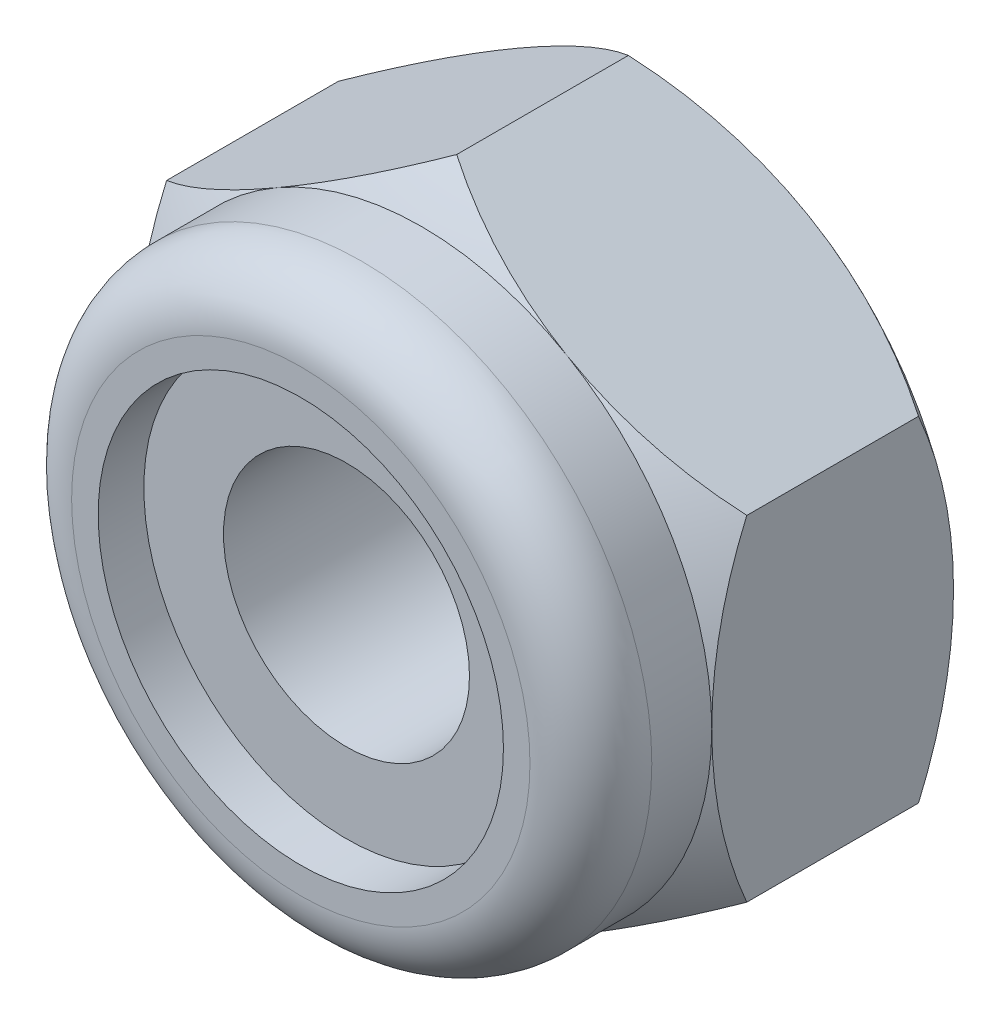
ISO-10303-21;
HEADER;
FILE_DESCRIPTION(('STEP AP214'),'2;1');
FILE_NAME('part.step','',(''),(''),'','','');
FILE_SCHEMA(('AUTOMOTIVE_DESIGN { 1 0 10303 214 1 1 1 1 }'));
ENDSEC;
DATA;
#1=APPLICATION_CONTEXT('core data for automotive mechanical design processes');
#2=APPLICATION_PROTOCOL_DEFINITION('international standard','automotive_design',2000,#1);
#3=PRODUCT_CONTEXT('',#1,'mechanical');
#4=PRODUCT('Part','Part','',(#3));
#5=PRODUCT_RELATED_PRODUCT_CATEGORY('part','',(#4));
#6=PRODUCT_DEFINITION_FORMATION('','',#4);
#7=PRODUCT_DEFINITION_CONTEXT('part definition',#1,'design');
#8=PRODUCT_DEFINITION('design','',#6,#7);
#9=PRODUCT_DEFINITION_SHAPE('','',#8);
#10=(LENGTH_UNIT() NAMED_UNIT(*) SI_UNIT(.MILLI.,.METRE.));
#11=(NAMED_UNIT(*) PLANE_ANGLE_UNIT() SI_UNIT($,.RADIAN.));
#12=(NAMED_UNIT(*) SI_UNIT($,.STERADIAN.) SOLID_ANGLE_UNIT());
#13=UNCERTAINTY_MEASURE_WITH_UNIT(LENGTH_MEASURE(1.E-05),#10,'distance_accuracy_value','');
#14=(GEOMETRIC_REPRESENTATION_CONTEXT(3) GLOBAL_UNCERTAINTY_ASSIGNED_CONTEXT((#13)) GLOBAL_UNIT_ASSIGNED_CONTEXT((#10,
#11,#12)) REPRESENTATION_CONTEXT('',''));
#15=CARTESIAN_POINT('',(0.,0.,0.));
#16=DIRECTION('',(0.,0.,1.));
#17=DIRECTION('',(1.,0.,0.));
#18=AXIS2_PLACEMENT_3D('',#15,#16,#17);
#19=CARTESIAN_POINT('',(0.,1.24344978758018E-11,4.95312499999961));
#20=DIRECTION('',(0.,0.,1.));
#21=DIRECTION('',(1.,0.,0.));
#22=AXIS2_PLACEMENT_3D('',#19,#20,#21);
#23=TOROIDAL_SURFACE('',#22,3.7625,1.);
#24=CARTESIAN_POINT('',(0.,1.24344978758018E-11,4.95312499999961));
#25=DIRECTION('',(0.,0.,-1.));
#26=DIRECTION('',(-1.,0.,0.));
#27=AXIS2_PLACEMENT_3D('',#24,#25,#26);
#28=CIRCLE('',#27,4.7625);
#29=CARTESIAN_POINT('',(-4.7625,1.24344978758018E-11,4.95312499999961));
#30=VERTEX_POINT('',#29);
#31=EDGE_CURVE('E161',#30,#30,#28,.T.);
#32=ORIENTED_EDGE('',*,*,#31,.F.);
#33=EDGE_LOOP('',(#32));
#34=FACE_BOUND('',#33,.T.);
#35=CARTESIAN_POINT('',(0.,1.24344978758018E-11,5.95312499999961));
#36=DIRECTION('',(0.,0.,-1.));
#37=DIRECTION('',(1.,0.,0.));
#38=AXIS2_PLACEMENT_3D('',#35,#36,#37);
#39=CIRCLE('',#38,3.7625);
#40=CARTESIAN_POINT('',(-3.7625,1.24349831420959E-11,5.95312499999961));
#41=VERTEX_POINT('',#40);
#42=CARTESIAN_POINT('',(3.7625,1.24344978758018E-11,5.95312499999961));
#43=VERTEX_POINT('',#42);
#44=EDGE_CURVE('E169',#41,#43,#39,.F.);
#45=ORIENTED_EDGE('',*,*,#44,.F.);
#46=CARTESIAN_POINT('',(0.,1.24344978758018E-11,5.95312499999961));
#47=DIRECTION('',(0.,0.,-1.));
#48=DIRECTION('',(-1.,0.,0.));
#49=AXIS2_PLACEMENT_3D('',#46,#47,#48);
#50=CIRCLE('',#49,3.7625);
#51=EDGE_CURVE('E167',#43,#41,#50,.F.);
#52=ORIENTED_EDGE('',*,*,#51,.F.);
#53=EDGE_LOOP('',(#45,#52));
#54=FACE_BOUND('',#53,.T.);
#55=ADVANCED_FACE('F16',(#34,#54),#23,.T.);
#56=CARTESIAN_POINT('',(0.,1.24344978758018E-11,5.95312499999961));
#57=DIRECTION('',(0.,0.,1.));
#58=DIRECTION('',(1.,0.,0.));
#59=AXIS2_PLACEMENT_3D('',#56,#57,#58);
#60=PLANE('',#59);
#61=CARTESIAN_POINT('',(0.,1.24344978758018E-11,5.95312499999961));
#62=DIRECTION('',(0.,0.,1.));
#63=DIRECTION('',(1.,0.,0.));
#64=AXIS2_PLACEMENT_3D('',#61,#62,#63);
#65=CIRCLE('',#64,3.32676299779793);
#66=CARTESIAN_POINT('',(3.32676299779793,1.24344978758018E-11,5.95312499999961));
#67=VERTEX_POINT('',#66);
#68=EDGE_CURVE('E128',#67,#67,#65,.F.);
#69=ORIENTED_EDGE('',*,*,#68,.T.);
#70=EDGE_LOOP('',(#69));
#71=FACE_BOUND('',#70,.T.);
#72=ORIENTED_EDGE('',*,*,#51,.T.);
#73=ORIENTED_EDGE('',*,*,#44,.T.);
#74=EDGE_LOOP('',(#72,#73));
#75=FACE_BOUND('',#74,.T.);
#76=ADVANCED_FACE('F175',(#71,#75),#60,.T.);
#77=CARTESIAN_POINT('',(0.,1.24344978758018E-11,5.95312499999961));
#78=DIRECTION('',(0.,0.,-1.));
#79=DIRECTION('',(-1.,0.,0.));
#80=AXIS2_PLACEMENT_3D('',#77,#78,#79);
#81=CYLINDRICAL_SURFACE('',#80,4.7625);
#82=ORIENTED_EDGE('',*,*,#31,.T.);
#83=EDGE_LOOP('',(#82));
#84=FACE_BOUND('',#83,.T.);
#85=CARTESIAN_POINT('',(0.,1.24344978758018E-11,3.96875000000001));
#86=DIRECTION('',(0.,0.,-1.));
#87=DIRECTION('',(-1.,0.,0.));
#88=AXIS2_PLACEMENT_3D('',#85,#86,#87);
#89=CIRCLE('',#88,4.7625);
#90=CARTESIAN_POINT('',(2.3812499999973,-4.12444598551874,3.96875));
#91=VERTEX_POINT('',#90);
#92=CARTESIAN_POINT('',(-2.3812499999973,-4.12444598551874,3.96875000000001));
#93=VERTEX_POINT('',#92);
#94=EDGE_CURVE('E110',#91,#93,#89,.T.);
#95=ORIENTED_EDGE('',*,*,#94,.F.);
#96=CARTESIAN_POINT('',(0.,1.24344978758018E-11,3.96875000000001));
#97=DIRECTION('',(0.,0.,-1.));
#98=DIRECTION('',(-1.,0.,0.));
#99=AXIS2_PLACEMENT_3D('',#96,#97,#98);
#100=CIRCLE('',#99,4.7625);
#101=CARTESIAN_POINT('',(4.76249999999073,3.10946746982632E-12,3.96875000000644));
#102=VERTEX_POINT('',#101);
#103=EDGE_CURVE('E151',#102,#91,#100,.T.);
#104=ORIENTED_EDGE('',*,*,#103,.F.);
#105=CARTESIAN_POINT('',(0.,1.24344978758018E-11,3.96875000000001));
#106=DIRECTION('',(0.,0.,-1.));
#107=DIRECTION('',(-1.,0.,0.));
#108=AXIS2_PLACEMENT_3D('',#105,#106,#107);
#109=CIRCLE('',#108,4.7625);
#110=CARTESIAN_POINT('',(2.38125000000269,4.12444598552807,3.96875));
#111=VERTEX_POINT('',#110);
#112=EDGE_CURVE('E153',#111,#102,#109,.T.);
#113=ORIENTED_EDGE('',*,*,#112,.F.);
#114=CARTESIAN_POINT('',(0.,1.24344978758018E-11,3.96874999999923));
#115=DIRECTION('',(0.,0.,-1.));
#116=DIRECTION('',(-1.,0.,0.));
#117=AXIS2_PLACEMENT_3D('',#114,#115,#116);
#118=CIRCLE('',#117,4.7625);
#119=CARTESIAN_POINT('',(-2.38125000000269,4.12444598552807,3.96874999999961));
#120=VERTEX_POINT('',#119);
#121=EDGE_CURVE('E156',#120,#111,#118,.T.);
#122=ORIENTED_EDGE('',*,*,#121,.F.);
#123=CARTESIAN_POINT('',(0.,1.24344978758018E-11,3.96874999999923));
#124=DIRECTION('',(0.,0.,-1.));
#125=DIRECTION('',(-1.,0.,0.));
#126=AXIS2_PLACEMENT_3D('',#123,#124,#125);
#127=CIRCLE('',#126,4.7625);
#128=CARTESIAN_POINT('',(-4.7624999999909,6.21720651084527E-12,3.96875000000634));
#129=VERTEX_POINT('',#128);
#130=EDGE_CURVE('E113',#129,#120,#127,.T.);
#131=ORIENTED_EDGE('',*,*,#130,.F.);
#132=CARTESIAN_POINT('',(0.,1.24344978758018E-11,3.96875000000001));
#133=DIRECTION('',(0.,0.,-1.));
#134=DIRECTION('',(-1.,0.,0.));
#135=AXIS2_PLACEMENT_3D('',#132,#133,#134);
#136=CIRCLE('',#135,4.7625);
#137=EDGE_CURVE('E107',#93,#129,#136,.T.);
#138=ORIENTED_EDGE('',*,*,#137,.F.);
#139=EDGE_LOOP('',(#95,#104,#113,#122,#131,#138));
#140=FACE_BOUND('',#139,.T.);
#141=ADVANCED_FACE('F109',(#84,#140),#81,.T.);
#142=CARTESIAN_POINT('',(0.,1.24344978758018E-11,5.95312499999961));
#143=DIRECTION('',(0.,0.,1.));
#144=DIRECTION('',(1.,0.,0.));
#145=AXIS2_PLACEMENT_3D('',#142,#143,#144);
#146=CYLINDRICAL_SURFACE('',#145,3.32676299779793);
#147=CARTESIAN_POINT('',(0.,1.24344978758018E-11,5.20312499999961));
#148=DIRECTION('',(0.,0.,1.));
#149=DIRECTION('',(1.,0.,0.));
#150=AXIS2_PLACEMENT_3D('',#147,#148,#149);
#151=CIRCLE('',#150,3.32676299779793);
#152=CARTESIAN_POINT('',(3.32676299779793,1.24344978758018E-11,5.20312499999961));
#153=VERTEX_POINT('',#152);
#154=EDGE_CURVE('E148',#153,#153,#151,.F.);
#155=ORIENTED_EDGE('',*,*,#154,.T.);
#156=EDGE_LOOP('',(#155));
#157=FACE_BOUND('',#156,.T.);
#158=ORIENTED_EDGE('',*,*,#68,.F.);
#159=EDGE_LOOP('',(#158));
#160=FACE_BOUND('',#159,.T.);
#161=ADVANCED_FACE('F295',(#157,#160),#146,.F.);
#162=CARTESIAN_POINT('',(0.,0.,-2.89662617308755));
#163=DIRECTION('',(1.,0.,0.));
#164=DIRECTION('',(0.,-0.514062280042827,0.857752861981334));
#165=AXIS2_PLACEMENT_3D('',#162,#163,#164);
#166=SPHERICAL_SURFACE('',#165,8.35552489362568);
#167=CARTESIAN_POINT('',(2.38125000000001,-4.12444598552341,-2.89662617308755));
#168=DIRECTION('',(0.5,-0.866025403784439,0.));
#169=DIRECTION('',(0.866025403784439,0.5,0.));
#170=AXIS2_PLACEMENT_3D('',#167,#168,#169);
#171=CIRCLE('',#170,6.86537617308755);
#172=CARTESIAN_POINT('',(3.73850256307762E-11,-5.4992613140528,3.39407499989474));
#173=VERTEX_POINT('',#172);
#174=EDGE_CURVE('E126',#91,#173,#171,.T.);
#175=ORIENTED_EDGE('',*,*,#174,.F.);
#176=ORIENTED_EDGE('',*,*,#94,.T.);
#177=CARTESIAN_POINT('',(-2.38125000000001,-4.12444598552341,-2.89662617308755));
#178=DIRECTION('',(-0.5,-0.866025403784439,0.));
#179=DIRECTION('',(0.866025403784439,-0.5,0.));
#180=AXIS2_PLACEMENT_3D('',#177,#178,#179);
#181=CIRCLE('',#180,6.86537617308755);
#182=EDGE_CURVE('E124',#173,#93,#181,.T.);
#183=ORIENTED_EDGE('',*,*,#182,.F.);
#184=EDGE_LOOP('',(#175,#176,#183));
#185=FACE_BOUND('',#184,.T.);
#186=ADVANCED_FACE('F122',(#185),#166,.T.);
#187=CARTESIAN_POINT('',(0.,0.,-2.89662617308763));
#188=DIRECTION('',(1.,0.,0.));
#189=DIRECTION('',(0.,0.0032458647859938,0.999994732167021));
#190=AXIS2_PLACEMENT_3D('',#187,#188,#189);
#191=SPHERICAL_SURFACE('',#190,8.35552489362576);
#192=CARTESIAN_POINT('',(-2.38124999999998,-4.12444598552343,-2.89662617308763));
#193=DIRECTION('',(-0.5,-0.866025403784439,0.));
#194=DIRECTION('',(0.866025403784439,-0.5,0.));
#195=AXIS2_PLACEMENT_3D('',#192,#193,#194);
#196=CIRCLE('',#195,6.86537617308764);
#197=CARTESIAN_POINT('',(-4.7625,-2.74963065700324,3.39407499991903));
#198=VERTEX_POINT('',#197);
#199=EDGE_CURVE('E130',#93,#198,#196,.T.);
#200=ORIENTED_EDGE('',*,*,#199,.F.);
#201=ORIENTED_EDGE('',*,*,#137,.T.);
#202=CARTESIAN_POINT('',(-4.7625,0.,-2.89662617308763));
#203=DIRECTION('',(1.,0.,0.));
#204=DIRECTION('',(0.,0.,-1.));
#205=AXIS2_PLACEMENT_3D('',#202,#203,#204);
#206=CIRCLE('',#205,6.86537617308764);
#207=EDGE_CURVE('E133',#198,#129,#206,.F.);
#208=ORIENTED_EDGE('',*,*,#207,.F.);
#209=EDGE_LOOP('',(#200,#201,#208));
#210=FACE_BOUND('',#209,.T.);
#211=ADVANCED_FACE('F131',(#210),#191,.T.);
#212=CARTESIAN_POINT('',(0.,0.,-2.89662617308756));
#213=DIRECTION('',(1.,0.,0.));
#214=DIRECTION('',(0.,0.517754599312731,0.855529178281205));
#215=AXIS2_PLACEMENT_3D('',#212,#213,#214);
#216=SPHERICAL_SURFACE('',#215,8.3555248936257);
#217=CARTESIAN_POINT('',(-4.76249999998179,0.,-2.89662617308756));
#218=DIRECTION('',(1.,0.,0.));
#219=DIRECTION('',(0.,0.,-1.));
#220=AXIS2_PLACEMENT_3D('',#217,#218,#219);
#221=CIRCLE('',#220,6.86537617310022);
#222=CARTESIAN_POINT('',(-4.76249999994811,2.74963065704558,3.39407499993981));
#223=VERTEX_POINT('',#222);
#224=EDGE_CURVE('E284',#129,#223,#221,.F.);
#225=ORIENTED_EDGE('',*,*,#224,.F.);
#226=ORIENTED_EDGE('',*,*,#130,.T.);
#227=CARTESIAN_POINT('',(-2.38125000000002,4.1244459855234,-2.89662617308756));
#228=DIRECTION('',(-0.5,0.866025403784439,0.));
#229=DIRECTION('',(-0.866025403784439,-0.5,0.));
#230=AXIS2_PLACEMENT_3D('',#227,#228,#229);
#231=CIRCLE('',#230,6.86537617308755);
#232=EDGE_CURVE('E280',#223,#120,#231,.T.);
#233=ORIENTED_EDGE('',*,*,#232,.F.);
#234=EDGE_LOOP('',(#225,#226,#233));
#235=FACE_BOUND('',#234,.T.);
#236=ADVANCED_FACE('F399',(#235),#216,.T.);
#237=CARTESIAN_POINT('',(0.,0.,-2.89662617308755));
#238=DIRECTION('',(1.,0.,0.));
#239=DIRECTION('',(0.,0.658959645209424,0.752178294013773));
#240=AXIS2_PLACEMENT_3D('',#237,#238,#239);
#241=SPHERICAL_SURFACE('',#240,8.35552489362569);
#242=ORIENTED_EDGE('',*,*,#121,.T.);
#243=CARTESIAN_POINT('',(2.38125000000002,4.1244459855234,-2.89662617308755));
#244=DIRECTION('',(0.5,0.866025403784439,0.));
#245=DIRECTION('',(-0.866025403784439,0.5,0.));
#246=AXIS2_PLACEMENT_3D('',#243,#244,#245);
#247=CIRCLE('',#246,6.86537617308755);
#248=CARTESIAN_POINT('',(4.83558505737225E-11,5.4992613140033,3.39407499993801));
#249=VERTEX_POINT('',#248);
#250=EDGE_CURVE('E274',#249,#111,#247,.T.);
#251=ORIENTED_EDGE('',*,*,#250,.F.);
#252=CARTESIAN_POINT('',(-2.38125000000002,4.1244459855234,-2.89662617308755));
#253=DIRECTION('',(-0.5,0.866025403784439,0.));
#254=DIRECTION('',(-0.866025403784439,-0.5,0.));
#255=AXIS2_PLACEMENT_3D('',#252,#253,#254);
#256=CIRCLE('',#255,6.86537617308755);
#257=EDGE_CURVE('E278',#120,#249,#256,.T.);
#258=ORIENTED_EDGE('',*,*,#257,.F.);
#259=EDGE_LOOP('',(#242,#251,#258));
#260=FACE_BOUND('',#259,.T.);
#261=ADVANCED_FACE('F356',(#260),#241,.T.);
#262=CARTESIAN_POINT('',(0.,0.,-2.89662617308756));
#263=DIRECTION('',(1.,0.,0.));
#264=DIRECTION('',(0.,0.517754599312728,0.855529178281206));
#265=AXIS2_PLACEMENT_3D('',#262,#263,#264);
#266=SPHERICAL_SURFACE('',#265,8.35552489362569);
#267=ORIENTED_EDGE('',*,*,#112,.T.);
#268=CARTESIAN_POINT('',(4.7625,0.,-2.89662617308756));
#269=DIRECTION('',(1.,0.,0.));
#270=DIRECTION('',(0.,0.,-1.));
#271=AXIS2_PLACEMENT_3D('',#268,#269,#270);
#272=CIRCLE('',#271,6.86537617308757);
#273=CARTESIAN_POINT('',(4.7625,2.74963065695977,3.39407499993803));
#274=VERTEX_POINT('',#273);
#275=EDGE_CURVE('E268',#274,#102,#272,.T.);
#276=ORIENTED_EDGE('',*,*,#275,.F.);
#277=CARTESIAN_POINT('',(2.38125000000001,4.12444598552341,-2.89662617308756));
#278=DIRECTION('',(0.5,0.866025403784439,0.));
#279=DIRECTION('',(-0.866025403784439,0.5,0.));
#280=AXIS2_PLACEMENT_3D('',#277,#278,#279);
#281=CIRCLE('',#280,6.86537617308756);
#282=EDGE_CURVE('E272',#111,#274,#281,.T.);
#283=ORIENTED_EDGE('',*,*,#282,.F.);
#284=EDGE_LOOP('',(#267,#276,#283));
#285=FACE_BOUND('',#284,.T.);
#286=ADVANCED_FACE('F344',(#285),#266,.T.);
#287=CARTESIAN_POINT('',(0.,0.,-2.89662617308763));
#288=DIRECTION('',(1.,0.,0.));
#289=DIRECTION('',(0.,0.00324586478599376,0.999994732167021));
#290=AXIS2_PLACEMENT_3D('',#287,#288,#289);
#291=SPHERICAL_SURFACE('',#290,8.35552489362577);
#292=ORIENTED_EDGE('',*,*,#103,.T.);
#293=CARTESIAN_POINT('',(2.38124999999998,-4.12444598552343,-2.89662617308763));
#294=DIRECTION('',(0.5,-0.866025403784439,0.));
#295=DIRECTION('',(0.866025403784439,0.5,0.));
#296=AXIS2_PLACEMENT_3D('',#293,#294,#295);
#297=CIRCLE('',#296,6.86537617308764);
#298=CARTESIAN_POINT('',(4.76249999998147,-2.74963065704567,3.39407499991452));
#299=VERTEX_POINT('',#298);
#300=EDGE_CURVE('E146',#299,#91,#297,.T.);
#301=ORIENTED_EDGE('',*,*,#300,.F.);
#302=CARTESIAN_POINT('',(4.76249999998147,0.,-2.89662617308763));
#303=DIRECTION('',(1.,0.,0.));
#304=DIRECTION('',(0.,0.,-1.));
#305=AXIS2_PLACEMENT_3D('',#302,#303,#304);
#306=CIRCLE('',#305,6.8653761731005);
#307=EDGE_CURVE('E265',#102,#299,#306,.T.);
#308=ORIENTED_EDGE('',*,*,#307,.F.);
#309=EDGE_LOOP('',(#292,#301,#308));
#310=FACE_BOUND('',#309,.T.);
#311=ADVANCED_FACE('F339',(#310),#291,.T.);
#312=CARTESIAN_POINT('',(2.01930000000006,1.24344978758018E-11,5.20312499999961));
#313=DIRECTION('',(0.,0.,-1.));
#314=DIRECTION('',(-1.,0.,0.));
#315=AXIS2_PLACEMENT_3D('',#312,#313,#314);
#316=PLANE('',#315);
#317=ORIENTED_EDGE('',*,*,#154,.F.);
#318=EDGE_LOOP('',(#317));
#319=FACE_BOUND('',#318,.T.);
#320=CARTESIAN_POINT('',(0.,1.24344978758018E-11,5.20312499999961));
#321=DIRECTION('',(0.,0.,1.));
#322=DIRECTION('',(1.,0.,0.));
#323=AXIS2_PLACEMENT_3D('',#320,#321,#322);
#324=CIRCLE('',#323,2.01930000000001);
#325=CARTESIAN_POINT('',(2.01930000000001,1.24344978758018E-11,5.20312499999961));
#326=VERTEX_POINT('',#325);
#327=EDGE_CURVE('E261',#326,#326,#324,.F.);
#328=ORIENTED_EDGE('',*,*,#327,.T.);
#329=EDGE_LOOP('',(#328));
#330=FACE_BOUND('',#329,.T.);
#331=ADVANCED_FACE('F336',(#319,#330),#316,.F.);
#332=CARTESIAN_POINT('',(2.38125,-4.12444598552342,1.984375));
#333=DIRECTION('',(0.5,-0.866025403784439,0.));
#334=DIRECTION('',(0.866025403784439,0.5,0.));
#335=AXIS2_PLACEMENT_3D('',#332,#333,#334);
#336=PLANE('',#335);
#337=CARTESIAN_POINT('',(2.3812500000054,-4.1244459855203,6.86537617308718));
#338=DIRECTION('',(0.5,-0.866025403784439,0.));
#339=DIRECTION('',(0.866025403784439,0.5,0.));
#340=AXIS2_PLACEMENT_3D('',#337,#338,#339);
#341=CIRCLE('',#340,6.86537617308008);
#342=CARTESIAN_POINT('',(2.38124999999744,-4.12444598551899,3.55054527445553E-12));
#343=VERTEX_POINT('',#342);
#344=CARTESIAN_POINT('',(3.73854593116452E-11,-5.4992613140528,0.57467500011576));
#345=VERTEX_POINT('',#344);
#346=EDGE_CURVE('E252',#343,#345,#341,.F.);
#347=ORIENTED_EDGE('',*,*,#346,.F.);
#348=CARTESIAN_POINT('',(2.38125000000536,-4.12444598552032,6.86537617308723));
#349=DIRECTION('',(0.5,-0.866025403784439,0.));
#350=DIRECTION('',(0.866025403784439,0.5,0.));
#351=AXIS2_PLACEMENT_3D('',#348,#349,#350);
#352=CIRCLE('',#351,6.86537617308013);
#353=CARTESIAN_POINT('',(4.76250000000017,-2.74963065704027,0.574675000102356));
#354=VERTEX_POINT('',#353);
#355=EDGE_CURVE('E255',#354,#343,#352,.F.);
#356=ORIENTED_EDGE('',*,*,#355,.F.);
#357=DIRECTION('',(0.,0.,-1.));
#358=VECTOR('',#357,1.);
#359=CARTESIAN_POINT('',(4.7625,-2.74963065706502,1.984375));
#360=LINE('',#359,#358);
#361=EDGE_CURVE('E264',#299,#354,#360,.T.);
#362=ORIENTED_EDGE('',*,*,#361,.F.);
#363=ORIENTED_EDGE('',*,*,#300,.T.);
#364=ORIENTED_EDGE('',*,*,#174,.T.);
#365=DIRECTION('',(0.,0.,1.));
#366=VECTOR('',#365,1.);
#367=CARTESIAN_POINT('',(7.47700512615523E-11,-5.49926131407438,1.984375));
#368=LINE('',#367,#366);
#369=EDGE_CURVE('E140',#345,#173,#368,.T.);
#370=ORIENTED_EDGE('',*,*,#369,.F.);
#371=EDGE_LOOP('',(#347,#356,#362,#363,#364,#370));
#372=FACE_BOUND('',#371,.T.);
#373=ADVANCED_FACE('F333',(#372),#336,.T.);
#374=CARTESIAN_POINT('',(-2.38125,-4.12444598552342,1.984375));
#375=DIRECTION('',(-0.5,-0.866025403784439,0.));
#376=DIRECTION('',(0.866025403784439,-0.5,0.));
#377=AXIS2_PLACEMENT_3D('',#374,#375,#376);
#378=PLANE('',#377);
#379=CARTESIAN_POINT('',(-2.38125000000538,-4.12444598552031,6.86537617308721));
#380=DIRECTION('',(-0.5,-0.866025403784439,0.));
#381=DIRECTION('',(0.866025403784439,-0.5,0.));
#382=AXIS2_PLACEMENT_3D('',#379,#380,#381);
#383=CIRCLE('',#382,6.86537617308011);
#384=CARTESIAN_POINT('',(-2.38124999999744,-4.12444598551899,3.54924423184855E-12));
#385=VERTEX_POINT('',#384);
#386=CARTESIAN_POINT('',(-4.76249999999733,-2.74963065700014,0.574675000082663));
#387=VERTEX_POINT('',#386);
#388=EDGE_CURVE('E243',#385,#387,#383,.F.);
#389=ORIENTED_EDGE('',*,*,#388,.F.);
#390=CARTESIAN_POINT('',(-2.3812500000054,-4.1244459855203,6.86537617308718));
#391=DIRECTION('',(-0.5,-0.866025403784439,0.));
#392=DIRECTION('',(0.866025403784439,-0.5,0.));
#393=AXIS2_PLACEMENT_3D('',#390,#391,#392);
#394=CIRCLE('',#393,6.86537617308008);
#395=EDGE_CURVE('E249',#345,#385,#394,.F.);
#396=ORIENTED_EDGE('',*,*,#395,.F.);
#397=ORIENTED_EDGE('',*,*,#369,.T.);
#398=ORIENTED_EDGE('',*,*,#182,.T.);
#399=ORIENTED_EDGE('',*,*,#199,.T.);
#400=DIRECTION('',(0.,0.,1.));
#401=VECTOR('',#400,1.);
#402=CARTESIAN_POINT('',(-4.7625,-2.74963065699085,1.984375));
#403=LINE('',#402,#401);
#404=EDGE_CURVE('E136',#387,#198,#403,.T.);
#405=ORIENTED_EDGE('',*,*,#404,.F.);
#406=EDGE_LOOP('',(#389,#396,#397,#398,#399,#405));
#407=FACE_BOUND('',#406,.T.);
#408=ADVANCED_FACE('F138',(#407),#378,.T.);
#409=CARTESIAN_POINT('',(-4.7625,0.,1.984375));
#410=DIRECTION('',(-1.,0.,0.));
#411=DIRECTION('',(0.,0.,1.));
#412=AXIS2_PLACEMENT_3D('',#409,#410,#411);
#413=PLANE('',#412);
#414=CARTESIAN_POINT('',(-4.7625000000002,1.24373023356119E-11,6.86537617308717));
#415=DIRECTION('',(1.,0.,0.));
#416=DIRECTION('',(0.,0.,-1.));
#417=AXIS2_PLACEMENT_3D('',#414,#415,#416);
#418=CIRCLE('',#417,6.86537617308743);
#419=CARTESIAN_POINT('',(-4.7624999999964,6.210826019676E-12,-2.87747256577653E-12));
#420=VERTEX_POINT('',#419);
#421=CARTESIAN_POINT('',(-4.7624999999573,2.74963065704027,0.574675000059021));
#422=VERTEX_POINT('',#421);
#423=EDGE_CURVE('E240',#420,#422,#418,.T.);
#424=ORIENTED_EDGE('',*,*,#423,.F.);
#425=CARTESIAN_POINT('',(-4.76249999998394,1.24086938640966E-11,6.86537617308721));
#426=DIRECTION('',(1.,0.,0.));
#427=DIRECTION('',(0.,0.,-1.));
#428=AXIS2_PLACEMENT_3D('',#425,#426,#427);
#429=CIRCLE('',#428,6.86537617309872);
#430=EDGE_CURVE('E246',#387,#420,#429,.T.);
#431=ORIENTED_EDGE('',*,*,#430,.F.);
#432=ORIENTED_EDGE('',*,*,#404,.T.);
#433=ORIENTED_EDGE('',*,*,#207,.T.);
#434=ORIENTED_EDGE('',*,*,#224,.T.);
#435=DIRECTION('',(0.,0.,1.));
#436=VECTOR('',#435,1.);
#437=CARTESIAN_POINT('',(-4.76249999991442,2.74963065706503,1.98437499999923));
#438=LINE('',#437,#436);
#439=EDGE_CURVE('E283',#422,#223,#438,.T.);
#440=ORIENTED_EDGE('',*,*,#439,.F.);
#441=EDGE_LOOP('',(#424,#431,#432,#433,#434,#440));
#442=FACE_BOUND('',#441,.T.);
#443=ADVANCED_FACE('F327',(#442),#413,.T.);
#444=CARTESIAN_POINT('',(-2.38125,4.12444598552342,1.98437499999923));
#445=DIRECTION('',(-0.5,0.866025403784439,0.));
#446=DIRECTION('',(-0.866025403784439,-0.5,0.));
#447=AXIS2_PLACEMENT_3D('',#444,#445,#446);
#448=PLANE('',#447);
#449=CARTESIAN_POINT('',(-2.38124999999462,4.12444598552652,6.86537617308721));
#450=DIRECTION('',(-0.5,0.866025403784439,0.));
#451=DIRECTION('',(-0.866025403784439,-0.5,0.));
#452=AXIS2_PLACEMENT_3D('',#449,#450,#451);
#453=CIRCLE('',#452,6.86537617309504);
#454=CARTESIAN_POINT('',(-2.38125000000283,4.12444598552831,-3.91830665136261E-12));
#455=VERTEX_POINT('',#454);
#456=CARTESIAN_POINT('',(4.83562842545915E-11,5.4992613140033,0.574675000050742));
#457=VERTEX_POINT('',#456);
#458=EDGE_CURVE('E234',#455,#457,#453,.F.);
#459=ORIENTED_EDGE('',*,*,#458,.F.);
#460=CARTESIAN_POINT('',(-2.38124999999463,4.12444598552652,6.86537617308718));
#461=DIRECTION('',(-0.5,0.866025403784439,0.));
#462=DIRECTION('',(-0.866025403784439,-0.5,0.));
#463=AXIS2_PLACEMENT_3D('',#460,#461,#462);
#464=CIRCLE('',#463,6.86537617309502);
#465=EDGE_CURVE('E237',#422,#455,#464,.F.);
#466=ORIENTED_EDGE('',*,*,#465,.F.);
#467=ORIENTED_EDGE('',*,*,#439,.T.);
#468=ORIENTED_EDGE('',*,*,#232,.T.);
#469=ORIENTED_EDGE('',*,*,#257,.T.);
#470=DIRECTION('',(0.,0.,1.));
#471=VECTOR('',#470,1.);
#472=CARTESIAN_POINT('',(9.6712134828314E-11,5.49926131397538,1.98437499999923));
#473=LINE('',#472,#471);
#474=EDGE_CURVE('E277',#457,#249,#473,.T.);
#475=ORIENTED_EDGE('',*,*,#474,.F.);
#476=EDGE_LOOP('',(#459,#466,#467,#468,#469,#475));
#477=FACE_BOUND('',#476,.T.);
#478=ADVANCED_FACE('F324',(#477),#448,.T.);
#479=CARTESIAN_POINT('',(2.38125,4.12444598552342,1.98437499999923));
#480=DIRECTION('',(0.5,0.866025403784439,0.));
#481=DIRECTION('',(-0.866025403784439,0.5,0.));
#482=AXIS2_PLACEMENT_3D('',#479,#480,#481);
#483=PLANE('',#482);
#484=CARTESIAN_POINT('',(2.38124999999461,4.12444598552653,6.86537617308722));
#485=DIRECTION('',(0.5,0.866025403784439,0.));
#486=DIRECTION('',(-0.866025403784439,0.5,0.));
#487=AXIS2_PLACEMENT_3D('',#484,#485,#486);
#488=CIRCLE('',#487,6.86537617309507);
#489=CARTESIAN_POINT('',(2.38125000000283,4.12444598552832,-3.92437818352853E-12));
#490=VERTEX_POINT('',#489);
#491=CARTESIAN_POINT('',(4.76250000000939,2.74963065695706,0.574675000062079));
#492=VERTEX_POINT('',#491);
#493=EDGE_CURVE('E37',#490,#492,#488,.F.);
#494=ORIENTED_EDGE('',*,*,#493,.F.);
#495=CARTESIAN_POINT('',(2.38124999999462,4.12444598552652,6.86537617308721));
#496=DIRECTION('',(0.5,0.866025403784439,0.));
#497=DIRECTION('',(-0.866025403784439,0.5,0.));
#498=AXIS2_PLACEMENT_3D('',#495,#496,#497);
#499=CIRCLE('',#498,6.86537617309504);
#500=EDGE_CURVE('E232',#457,#490,#499,.F.);
#501=ORIENTED_EDGE('',*,*,#500,.F.);
#502=ORIENTED_EDGE('',*,*,#474,.T.);
#503=ORIENTED_EDGE('',*,*,#250,.T.);
#504=ORIENTED_EDGE('',*,*,#282,.T.);
#505=DIRECTION('',(0.,0.,-1.));
#506=VECTOR('',#505,1.);
#507=CARTESIAN_POINT('',(4.7625,2.74963065690392,1.984375));
#508=LINE('',#507,#506);
#509=EDGE_CURVE('E271',#492,#274,#508,.F.);
#510=ORIENTED_EDGE('',*,*,#509,.F.);
#511=EDGE_LOOP('',(#494,#501,#502,#503,#504,#510));
#512=FACE_BOUND('',#511,.T.);
#513=ADVANCED_FACE('F320',(#512),#483,.T.);
#514=CARTESIAN_POINT('',(4.7625,0.,1.984375));
#515=DIRECTION('',(1.,0.,0.));
#516=DIRECTION('',(0.,0.,-1.));
#517=AXIS2_PLACEMENT_3D('',#514,#515,#516);
#518=PLANE('',#517);
#519=CARTESIAN_POINT('',(4.76250000000017,1.23976350019372E-11,6.86537617308723));
#520=DIRECTION('',(1.,0.,0.));
#521=DIRECTION('',(0.,0.,-1.));
#522=AXIS2_PLACEMENT_3D('',#519,#520,#521);
#523=CIRCLE('',#522,6.86537617308747);
#524=CARTESIAN_POINT('',(4.76250000000257,6.21704829444962E-12,1.41141438814163E-12));
#525=VERTEX_POINT('',#524);
#526=EDGE_CURVE('E258',#525,#354,#523,.F.);
#527=ORIENTED_EDGE('',*,*,#526,.F.);
#528=CARTESIAN_POINT('',(4.76250000000939,1.24345673325034E-11,6.86537617308722));
#529=DIRECTION('',(1.,0.,0.));
#530=DIRECTION('',(0.,0.,-1.));
#531=AXIS2_PLACEMENT_3D('',#528,#529,#530);
#532=CIRCLE('',#531,6.8653761730811);
#533=EDGE_CURVE('E228',#492,#525,#532,.F.);
#534=ORIENTED_EDGE('',*,*,#533,.F.);
#535=ORIENTED_EDGE('',*,*,#509,.T.);
#536=ORIENTED_EDGE('',*,*,#275,.T.);
#537=ORIENTED_EDGE('',*,*,#307,.T.);
#538=ORIENTED_EDGE('',*,*,#361,.T.);
#539=EDGE_LOOP('',(#527,#534,#535,#536,#537,#538));
#540=FACE_BOUND('',#539,.T.);
#541=ADVANCED_FACE('F316',(#540),#518,.T.);
#542=CARTESIAN_POINT('',(0.,1.24344978758018E-11,5.95312499999961));
#543=DIRECTION('',(0.,0.,1.));
#544=DIRECTION('',(1.,0.,0.));
#545=AXIS2_PLACEMENT_3D('',#542,#543,#544);
#546=CYLINDRICAL_SURFACE('',#545,2.01930000000001);
#547=CARTESIAN_POINT('',(0.,1.24344978758018E-11,0.));
#548=DIRECTION('',(0.,0.,1.));
#549=DIRECTION('',(1.,0.,0.));
#550=AXIS2_PLACEMENT_3D('',#547,#548,#549);
#551=CIRCLE('',#550,2.01930000000001);
#552=CARTESIAN_POINT('',(2.01930000000001,1.24344978758018E-11,0.));
#553=VERTEX_POINT('',#552);
#554=EDGE_CURVE('E225',#553,#553,#551,.T.);
#555=ORIENTED_EDGE('',*,*,#554,.F.);
#556=EDGE_LOOP('',(#555));
#557=FACE_BOUND('',#556,.T.);
#558=ORIENTED_EDGE('',*,*,#327,.F.);
#559=EDGE_LOOP('',(#558));
#560=FACE_BOUND('',#559,.T.);
#561=ADVANCED_FACE('F312',(#557,#560),#546,.F.);
#562=CARTESIAN_POINT('',(0.,1.23976350019372E-11,6.86537617308723));
#563=DIRECTION('',(1.,0.,0.));
#564=DIRECTION('',(0.,-0.517754599313837,-0.855529178280535));
#565=AXIS2_PLACEMENT_3D('',#562,#563,#564);
#566=SPHERICAL_SURFACE('',#565,8.35552489362571);
#567=ORIENTED_EDGE('',*,*,#355,.T.);
#568=CARTESIAN_POINT('',(0.,1.23976350019372E-11,0.));
#569=DIRECTION('',(0.,0.,-1.));
#570=DIRECTION('',(-1.,0.,0.));
#571=AXIS2_PLACEMENT_3D('',#568,#569,#570);
#572=CIRCLE('',#571,4.76250000000054);
#573=EDGE_CURVE('E222',#525,#343,#572,.T.);
#574=ORIENTED_EDGE('',*,*,#573,.F.);
#575=ORIENTED_EDGE('',*,*,#526,.T.);
#576=EDGE_LOOP('',(#567,#574,#575));
#577=FACE_BOUND('',#576,.T.);
#578=ADVANCED_FACE('F315',(#577),#566,.T.);
#579=CARTESIAN_POINT('',(0.,1.24336305140638E-11,6.86537617308718));
#580=DIRECTION('',(1.,0.,0.));
#581=DIRECTION('',(0.,-0.658959645215233,-0.752178294008684));
#582=AXIS2_PLACEMENT_3D('',#579,#580,#581);
#583=SPHERICAL_SURFACE('',#582,8.35552489362568);
#584=ORIENTED_EDGE('',*,*,#395,.T.);
#585=CARTESIAN_POINT('',(0.,1.24336305140638E-11,0.));
#586=DIRECTION('',(0.,0.,-1.));
#587=DIRECTION('',(-1.,0.,0.));
#588=AXIS2_PLACEMENT_3D('',#585,#586,#587);
#589=CIRCLE('',#588,4.76250000000056);
#590=EDGE_CURVE('E219',#343,#385,#589,.T.);
#591=ORIENTED_EDGE('',*,*,#590,.F.);
#592=ORIENTED_EDGE('',*,*,#346,.T.);
#593=EDGE_LOOP('',(#584,#591,#592));
#594=FACE_BOUND('',#593,.T.);
#595=ADVANCED_FACE('F363',(#594),#583,.T.);
#596=CARTESIAN_POINT('',(0.,1.24086938640966E-11,6.86537617308721));
#597=DIRECTION('',(1.,0.,0.));
#598=DIRECTION('',(0.,-0.517754599313839,-0.855529178280534));
#599=AXIS2_PLACEMENT_3D('',#596,#597,#598);
#600=SPHERICAL_SURFACE('',#599,8.3555248936257);
#601=CARTESIAN_POINT('',(0.,1.24086938640966E-11,0.));
#602=DIRECTION('',(0.,0.,-1.));
#603=DIRECTION('',(-1.,0.,0.));
#604=AXIS2_PLACEMENT_3D('',#601,#602,#603);
#605=CIRCLE('',#604,4.76250000000054);
#606=EDGE_CURVE('E216',#385,#420,#605,.T.);
#607=ORIENTED_EDGE('',*,*,#606,.F.);
#608=ORIENTED_EDGE('',*,*,#388,.T.);
#609=ORIENTED_EDGE('',*,*,#430,.T.);
#610=EDGE_LOOP('',(#607,#608,#609));
#611=FACE_BOUND('',#610,.T.);
#612=ADVANCED_FACE('F367',(#611),#600,.T.);
#613=CARTESIAN_POINT('',(0.,1.24345453096468E-11,6.86537617308718));
#614=DIRECTION('',(1.,0.,0.));
#615=DIRECTION('',(0.,-0.00324586478780732,-0.999994732167015));
#616=AXIS2_PLACEMENT_3D('',#613,#614,#615);
#617=SPHERICAL_SURFACE('',#616,8.35552489362568);
#618=ORIENTED_EDGE('',*,*,#465,.T.);
#619=CARTESIAN_POINT('',(0.,1.24345453096468E-11,0.));
#620=DIRECTION('',(0.,0.,-1.));
#621=DIRECTION('',(-1.,0.,0.));
#622=AXIS2_PLACEMENT_3D('',#619,#620,#621);
#623=CIRCLE('',#622,4.76250000000056);
#624=EDGE_CURVE('E213',#420,#455,#623,.T.);
#625=ORIENTED_EDGE('',*,*,#624,.F.);
#626=ORIENTED_EDGE('',*,*,#423,.T.);
#627=EDGE_LOOP('',(#618,#625,#626));
#628=FACE_BOUND('',#627,.T.);
#629=ADVANCED_FACE('F371',(#628),#617,.T.);
#630=CARTESIAN_POINT('',(0.,1.24453398975266E-11,6.86537617308721));
#631=DIRECTION('',(1.,0.,0.));
#632=DIRECTION('',(0.,0.514062280041625,-0.857752861982054));
#633=AXIS2_PLACEMENT_3D('',#630,#631,#632);
#634=SPHERICAL_SURFACE('',#633,8.3555248936257);
#635=ORIENTED_EDGE('',*,*,#500,.T.);
#636=CARTESIAN_POINT('',(0.,1.24453398975266E-11,0.));
#637=DIRECTION('',(0.,0.,-1.));
#638=DIRECTION('',(-1.,0.,0.));
#639=AXIS2_PLACEMENT_3D('',#636,#637,#638);
#640=CIRCLE('',#639,4.76250000000055);
#641=EDGE_CURVE('E28',#455,#490,#640,.T.);
#642=ORIENTED_EDGE('',*,*,#641,.F.);
#643=ORIENTED_EDGE('',*,*,#458,.T.);
#644=EDGE_LOOP('',(#635,#642,#643));
#645=FACE_BOUND('',#644,.T.);
#646=ADVANCED_FACE('F308',(#645),#634,.T.);
#647=CARTESIAN_POINT('',(0.,1.24345673325034E-11,6.86537617308722));
#648=DIRECTION('',(1.,0.,0.));
#649=DIRECTION('',(0.,-0.00324586478780731,-0.999994732167015));
#650=AXIS2_PLACEMENT_3D('',#647,#648,#649);
#651=SPHERICAL_SURFACE('',#650,8.35552489362573);
#652=ORIENTED_EDGE('',*,*,#533,.T.);
#653=CARTESIAN_POINT('',(0.,1.24345673325034E-11,0.));
#654=DIRECTION('',(0.,0.,-1.));
#655=DIRECTION('',(-1.,0.,0.));
#656=AXIS2_PLACEMENT_3D('',#653,#654,#655);
#657=CIRCLE('',#656,4.76250000000058);
#658=EDGE_CURVE('E11',#490,#525,#657,.T.);
#659=ORIENTED_EDGE('',*,*,#658,.F.);
#660=ORIENTED_EDGE('',*,*,#493,.T.);
#661=EDGE_LOOP('',(#652,#659,#660));
#662=FACE_BOUND('',#661,.T.);
#663=ADVANCED_FACE('F18',(#662),#651,.T.);
#664=CARTESIAN_POINT('',(0.,0.,0.));
#665=DIRECTION('',(0.,0.,-1.));
#666=DIRECTION('',(-1.,0.,0.));
#667=AXIS2_PLACEMENT_3D('',#664,#665,#666);
#668=PLANE('',#667);
#669=ORIENTED_EDGE('',*,*,#641,.T.);
#670=ORIENTED_EDGE('',*,*,#658,.T.);
#671=ORIENTED_EDGE('',*,*,#573,.T.);
#672=ORIENTED_EDGE('',*,*,#590,.T.);
#673=ORIENTED_EDGE('',*,*,#606,.T.);
#674=ORIENTED_EDGE('',*,*,#624,.T.);
#675=EDGE_LOOP('',(#669,#670,#671,#672,#673,#674));
#676=FACE_BOUND('',#675,.T.);
#677=ORIENTED_EDGE('',*,*,#554,.T.);
#678=EDGE_LOOP('',(#677));
#679=FACE_BOUND('',#678,.T.);
#680=ADVANCED_FACE('F301',(#676,#679),#668,.T.);
#681=CLOSED_SHELL('',(#55,#76,#141,#161,#186,#211,#236,#261,#286,#311,#331,#373,#408,#443,#478,
#513,#541,#561,#578,#595,#612,#629,#646,#663,#680));
#682=MANIFOLD_SOLID_BREP('B1',#681);
#683=ADVANCED_BREP_SHAPE_REPRESENTATION('',(#18,#682),#14);
#684=SHAPE_DEFINITION_REPRESENTATION(#9,#683);
ENDSEC;
END-ISO-10303-21;
